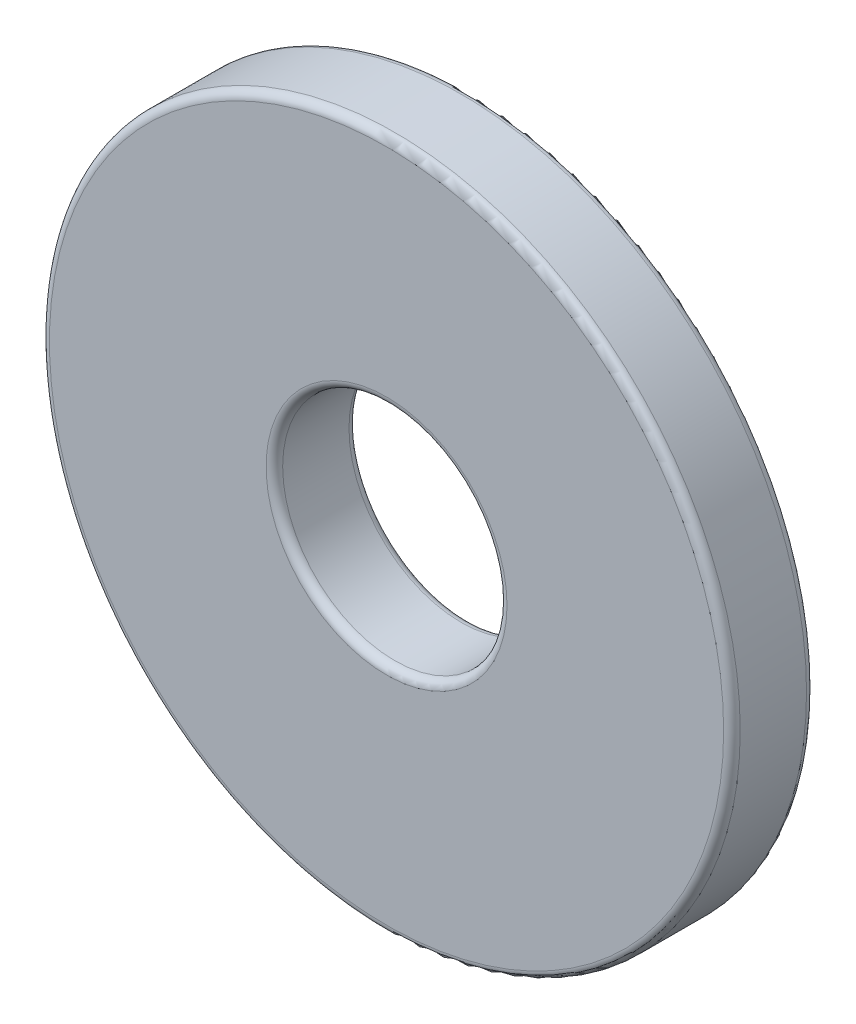
ISO-10303-21;
HEADER;
FILE_DESCRIPTION(('STEP AP214'),'2;1');
FILE_NAME('part.step','',(''),(''),'','','');
FILE_SCHEMA(('AUTOMOTIVE_DESIGN { 1 0 10303 214 1 1 1 1 }'));
ENDSEC;
DATA;
#1=APPLICATION_CONTEXT('core data for automotive mechanical design processes');
#2=APPLICATION_PROTOCOL_DEFINITION('international standard','automotive_design',2000,#1);
#3=PRODUCT_CONTEXT('',#1,'mechanical');
#4=PRODUCT('Part','Part','',(#3));
#5=PRODUCT_RELATED_PRODUCT_CATEGORY('part','',(#4));
#6=PRODUCT_DEFINITION_FORMATION('','',#4);
#7=PRODUCT_DEFINITION_CONTEXT('part definition',#1,'design');
#8=PRODUCT_DEFINITION('design','',#6,#7);
#9=PRODUCT_DEFINITION_SHAPE('','',#8);
#10=(LENGTH_UNIT() NAMED_UNIT(*) SI_UNIT(.MILLI.,.METRE.));
#11=(NAMED_UNIT(*) PLANE_ANGLE_UNIT() SI_UNIT($,.RADIAN.));
#12=(NAMED_UNIT(*) SI_UNIT($,.STERADIAN.) SOLID_ANGLE_UNIT());
#13=UNCERTAINTY_MEASURE_WITH_UNIT(LENGTH_MEASURE(1.E-05),#10,'distance_accuracy_value','');
#14=(GEOMETRIC_REPRESENTATION_CONTEXT(3) GLOBAL_UNCERTAINTY_ASSIGNED_CONTEXT((#13)) GLOBAL_UNIT_ASSIGNED_CONTEXT((#10,
#11,#12)) REPRESENTATION_CONTEXT('',''));
#15=CARTESIAN_POINT('',(0.,0.,0.));
#16=DIRECTION('',(0.,0.,1.));
#17=DIRECTION('',(1.,0.,0.));
#18=AXIS2_PLACEMENT_3D('',#15,#16,#17);
#19=CARTESIAN_POINT('',(0.,0.,-0.9525));
#20=DIRECTION('',(0.,0.,1.));
#21=DIRECTION('',(1.,0.,0.));
#22=AXIS2_PLACEMENT_3D('',#19,#20,#21);
#23=CYLINDRICAL_SURFACE('',#22,7.9375);
#24=CARTESIAN_POINT('',(0.,0.,0.762));
#25=DIRECTION('',(0.,0.,1.));
#26=DIRECTION('',(1.,0.,0.));
#27=AXIS2_PLACEMENT_3D('',#24,#25,#26);
#28=CIRCLE('',#27,7.9375);
#29=CARTESIAN_POINT('',(7.9375,0.,0.762));
#30=VERTEX_POINT('',#29);
#31=EDGE_CURVE('E10',#30,#30,#28,.F.);
#32=ORIENTED_EDGE('',*,*,#31,.T.);
#33=EDGE_LOOP('',(#32));
#34=FACE_BOUND('',#33,.T.);
#35=CARTESIAN_POINT('',(0.,0.,-0.762));
#36=DIRECTION('',(0.,0.,1.));
#37=DIRECTION('',(1.,0.,0.));
#38=AXIS2_PLACEMENT_3D('',#35,#36,#37);
#39=CIRCLE('',#38,7.9375);
#40=CARTESIAN_POINT('',(7.9375,0.,-0.762));
#41=VERTEX_POINT('',#40);
#42=EDGE_CURVE('E39',#41,#41,#39,.T.);
#43=ORIENTED_EDGE('',*,*,#42,.T.);
#44=EDGE_LOOP('',(#43));
#45=FACE_BOUND('',#44,.T.);
#46=ADVANCED_FACE('F32',(#34,#45),#23,.T.);
#47=CARTESIAN_POINT('',(0.,0.,-0.9525));
#48=DIRECTION('',(0.,0.,1.));
#49=DIRECTION('',(1.,0.,0.));
#50=AXIS2_PLACEMENT_3D('',#47,#48,#49);
#51=PLANE('',#50);
#52=CARTESIAN_POINT('',(0.,0.,-0.9525));
#53=DIRECTION('',(0.,0.,1.));
#54=DIRECTION('',(1.,0.,0.));
#55=AXIS2_PLACEMENT_3D('',#52,#53,#54);
#56=CIRCLE('',#55,2.7686);
#57=CARTESIAN_POINT('',(2.7686,0.,-0.9525));
#58=VERTEX_POINT('',#57);
#59=EDGE_CURVE('E43',#58,#58,#56,.T.);
#60=ORIENTED_EDGE('',*,*,#59,.T.);
#61=EDGE_LOOP('',(#60));
#62=FACE_BOUND('',#61,.T.);
#63=CARTESIAN_POINT('',(0.,0.,-0.9525));
#64=DIRECTION('',(0.,0.,1.));
#65=DIRECTION('',(1.,0.,0.));
#66=AXIS2_PLACEMENT_3D('',#63,#64,#65);
#67=CIRCLE('',#66,7.747);
#68=CARTESIAN_POINT('',(7.747,0.,-0.9525));
#69=VERTEX_POINT('',#68);
#70=EDGE_CURVE('E47',#69,#69,#67,.F.);
#71=ORIENTED_EDGE('',*,*,#70,.T.);
#72=EDGE_LOOP('',(#71));
#73=FACE_BOUND('',#72,.T.);
#74=ADVANCED_FACE('F75',(#62,#73),#51,.F.);
#75=CARTESIAN_POINT('',(0.,0.,0.9525));
#76=DIRECTION('',(0.,0.,1.));
#77=DIRECTION('',(1.,0.,0.));
#78=AXIS2_PLACEMENT_3D('',#75,#76,#77);
#79=PLANE('',#78);
#80=CARTESIAN_POINT('',(0.,0.,0.9525));
#81=DIRECTION('',(0.,0.,1.));
#82=DIRECTION('',(1.,0.,0.));
#83=AXIS2_PLACEMENT_3D('',#80,#81,#82);
#84=CIRCLE('',#83,2.7686);
#85=CARTESIAN_POINT('',(2.7686,0.,0.9525));
#86=VERTEX_POINT('',#85);
#87=EDGE_CURVE('E52',#86,#86,#84,.F.);
#88=ORIENTED_EDGE('',*,*,#87,.T.);
#89=EDGE_LOOP('',(#88));
#90=FACE_BOUND('',#89,.T.);
#91=CARTESIAN_POINT('',(0.,0.,0.9525));
#92=DIRECTION('',(0.,0.,1.));
#93=DIRECTION('',(1.,0.,0.));
#94=AXIS2_PLACEMENT_3D('',#91,#92,#93);
#95=CIRCLE('',#94,7.747);
#96=CARTESIAN_POINT('',(7.747,0.,0.9525));
#97=VERTEX_POINT('',#96);
#98=EDGE_CURVE('E55',#97,#97,#95,.T.);
#99=ORIENTED_EDGE('',*,*,#98,.T.);
#100=EDGE_LOOP('',(#99));
#101=FACE_BOUND('',#100,.T.);
#102=ADVANCED_FACE('F78',(#90,#101),#79,.T.);
#103=CARTESIAN_POINT('',(0.,0.,-0.9525));
#104=DIRECTION('',(0.,0.,1.));
#105=DIRECTION('',(1.,0.,0.));
#106=AXIS2_PLACEMENT_3D('',#103,#104,#105);
#107=CYLINDRICAL_SURFACE('',#106,2.5781);
#108=CARTESIAN_POINT('',(0.,0.,0.762));
#109=DIRECTION('',(0.,0.,1.));
#110=DIRECTION('',(1.,0.,0.));
#111=AXIS2_PLACEMENT_3D('',#108,#109,#110);
#112=CIRCLE('',#111,2.5781);
#113=CARTESIAN_POINT('',(2.5781,0.,0.762));
#114=VERTEX_POINT('',#113);
#115=EDGE_CURVE('E58',#114,#114,#112,.T.);
#116=ORIENTED_EDGE('',*,*,#115,.T.);
#117=EDGE_LOOP('',(#116));
#118=FACE_BOUND('',#117,.T.);
#119=CARTESIAN_POINT('',(0.,0.,-0.762));
#120=DIRECTION('',(0.,0.,1.));
#121=DIRECTION('',(1.,0.,0.));
#122=AXIS2_PLACEMENT_3D('',#119,#120,#121);
#123=CIRCLE('',#122,2.5781);
#124=CARTESIAN_POINT('',(2.5781,0.,-0.762));
#125=VERTEX_POINT('',#124);
#126=EDGE_CURVE('E61',#125,#125,#123,.F.);
#127=ORIENTED_EDGE('',*,*,#126,.T.);
#128=EDGE_LOOP('',(#127));
#129=FACE_BOUND('',#128,.T.);
#130=ADVANCED_FACE('F65',(#118,#129),#107,.F.);
#131=CARTESIAN_POINT('',(0.,0.,0.762));
#132=DIRECTION('',(0.,0.,1.));
#133=DIRECTION('',(1.,0.,0.));
#134=AXIS2_PLACEMENT_3D('',#131,#132,#133);
#135=TOROIDAL_SURFACE('',#134,2.7686,0.1905);
#136=ORIENTED_EDGE('',*,*,#87,.F.);
#137=EDGE_LOOP('',(#136));
#138=FACE_BOUND('',#137,.T.);
#139=ORIENTED_EDGE('',*,*,#115,.F.);
#140=EDGE_LOOP('',(#139));
#141=FACE_BOUND('',#140,.T.);
#142=ADVANCED_FACE('F71',(#138,#141),#135,.T.);
#143=CARTESIAN_POINT('',(0.,0.,-0.762));
#144=DIRECTION('',(0.,0.,1.));
#145=DIRECTION('',(1.,0.,0.));
#146=AXIS2_PLACEMENT_3D('',#143,#144,#145);
#147=TOROIDAL_SURFACE('',#146,2.7686,0.1905);
#148=ORIENTED_EDGE('',*,*,#126,.F.);
#149=EDGE_LOOP('',(#148));
#150=FACE_BOUND('',#149,.T.);
#151=ORIENTED_EDGE('',*,*,#59,.F.);
#152=EDGE_LOOP('',(#151));
#153=FACE_BOUND('',#152,.T.);
#154=ADVANCED_FACE('F67',(#150,#153),#147,.T.);
#155=CARTESIAN_POINT('',(0.,0.,0.762));
#156=DIRECTION('',(0.,0.,1.));
#157=DIRECTION('',(1.,0.,0.));
#158=AXIS2_PLACEMENT_3D('',#155,#156,#157);
#159=TOROIDAL_SURFACE('',#158,7.747,0.1905);
#160=ORIENTED_EDGE('',*,*,#31,.F.);
#161=EDGE_LOOP('',(#160));
#162=FACE_BOUND('',#161,.T.);
#163=ORIENTED_EDGE('',*,*,#98,.F.);
#164=EDGE_LOOP('',(#163));
#165=FACE_BOUND('',#164,.T.);
#166=ADVANCED_FACE('F70',(#162,#165),#159,.T.);
#167=CARTESIAN_POINT('',(0.,0.,-0.762));
#168=DIRECTION('',(0.,0.,1.));
#169=DIRECTION('',(1.,0.,0.));
#170=AXIS2_PLACEMENT_3D('',#167,#168,#169);
#171=TOROIDAL_SURFACE('',#170,7.747,0.1905);
#172=ORIENTED_EDGE('',*,*,#70,.F.);
#173=EDGE_LOOP('',(#172));
#174=FACE_BOUND('',#173,.T.);
#175=ORIENTED_EDGE('',*,*,#42,.F.);
#176=EDGE_LOOP('',(#175));
#177=FACE_BOUND('',#176,.T.);
#178=ADVANCED_FACE('F34',(#174,#177),#171,.T.);
#179=CLOSED_SHELL('',(#46,#74,#102,#130,#142,#154,#166,#178));
#180=MANIFOLD_SOLID_BREP('B2',#179);
#181=ADVANCED_BREP_SHAPE_REPRESENTATION('',(#18,#180),#14);
#182=SHAPE_DEFINITION_REPRESENTATION(#9,#181);
ENDSEC;
END-ISO-10303-21;
